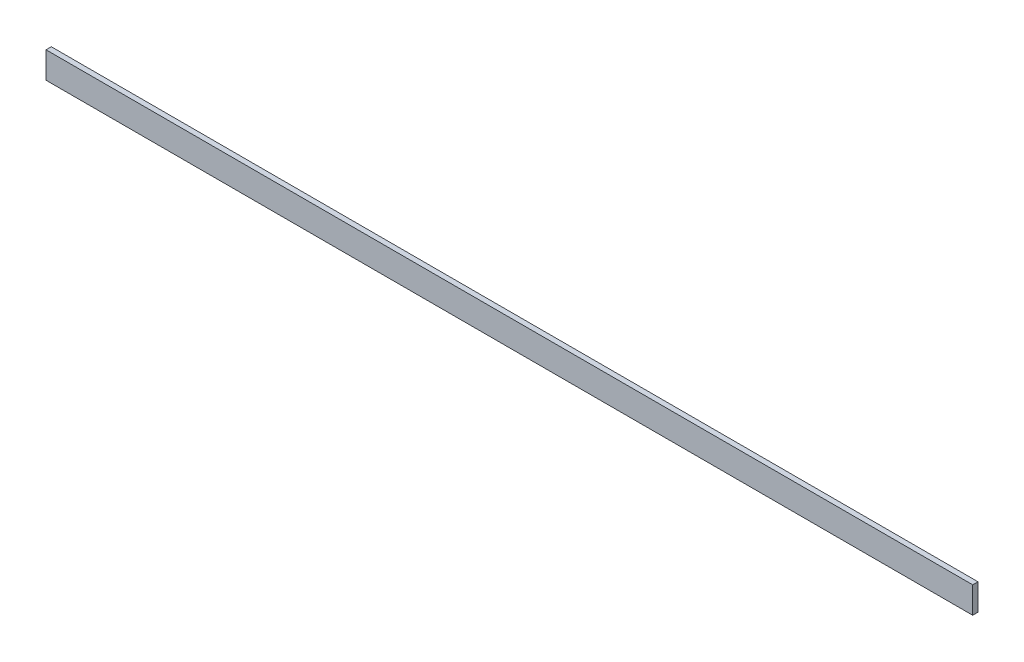
ISO-10303-21;
HEADER;
FILE_DESCRIPTION(('STEP AP214'),'2;1');
FILE_NAME('part.step','',(''),(''),'','','');
FILE_SCHEMA(('AUTOMOTIVE_DESIGN { 1 0 10303 214 1 1 1 1 }'));
ENDSEC;
DATA;
#1=APPLICATION_CONTEXT('core data for automotive mechanical design processes');
#2=APPLICATION_PROTOCOL_DEFINITION('international standard','automotive_design',2000,#1);
#3=PRODUCT_CONTEXT('',#1,'mechanical');
#4=PRODUCT('Part','Part','',(#3));
#5=PRODUCT_RELATED_PRODUCT_CATEGORY('part','',(#4));
#6=PRODUCT_DEFINITION_FORMATION('','',#4);
#7=PRODUCT_DEFINITION_CONTEXT('part definition',#1,'design');
#8=PRODUCT_DEFINITION('design','',#6,#7);
#9=PRODUCT_DEFINITION_SHAPE('','',#8);
#10=(LENGTH_UNIT() NAMED_UNIT(*) SI_UNIT(.MILLI.,.METRE.));
#11=(NAMED_UNIT(*) PLANE_ANGLE_UNIT() SI_UNIT($,.RADIAN.));
#12=(NAMED_UNIT(*) SI_UNIT($,.STERADIAN.) SOLID_ANGLE_UNIT());
#13=UNCERTAINTY_MEASURE_WITH_UNIT(LENGTH_MEASURE(1.E-05),#10,'distance_accuracy_value','');
#14=(GEOMETRIC_REPRESENTATION_CONTEXT(3) GLOBAL_UNCERTAINTY_ASSIGNED_CONTEXT((#13)) GLOBAL_UNIT_ASSIGNED_CONTEXT((#10,
#11,#12)) REPRESENTATION_CONTEXT('',''));
#15=CARTESIAN_POINT('',(0.,0.,0.));
#16=DIRECTION('',(0.,0.,1.));
#17=DIRECTION('',(1.,0.,0.));
#18=AXIS2_PLACEMENT_3D('',#15,#16,#17);
#19=CARTESIAN_POINT('',(-177.127492775907,4.72102869148791,2.));
#20=DIRECTION('',(1.,0.,0.));
#21=DIRECTION('',(0.,0.,-1.));
#22=AXIS2_PLACEMENT_3D('',#19,#20,#21);
#23=PLANE('',#22);
#24=DIRECTION('',(0.,-1.,0.));
#25=VECTOR('',#24,1.);
#26=CARTESIAN_POINT('',(-177.127492775907,4.72102869148791,0.));
#27=LINE('',#26,#25);
#28=CARTESIAN_POINT('',(-177.127492775907,4.72102869148791,0.));
#29=VERTEX_POINT('',#28);
#30=CARTESIAN_POINT('',(-177.127492775907,-5.27897130851209,0.));
#31=VERTEX_POINT('',#30);
#32=EDGE_CURVE('E96',#29,#31,#27,.T.);
#33=ORIENTED_EDGE('',*,*,#32,.T.);
#34=DIRECTION('',(0.,0.,-1.));
#35=VECTOR('',#34,1.);
#36=CARTESIAN_POINT('',(-177.127492775907,-5.27897130851209,2.));
#37=LINE('',#36,#35);
#38=CARTESIAN_POINT('',(-177.127492775907,-5.27897130851209,2.));
#39=VERTEX_POINT('',#38);
#40=EDGE_CURVE('E11',#39,#31,#37,.T.);
#41=ORIENTED_EDGE('',*,*,#40,.F.);
#42=DIRECTION('',(0.,-1.,0.));
#43=VECTOR('',#42,1.);
#44=CARTESIAN_POINT('',(-177.127492775907,4.72102869148791,2.));
#45=LINE('',#44,#43);
#46=CARTESIAN_POINT('',(-177.127492775907,4.72102869148791,2.));
#47=VERTEX_POINT('',#46);
#48=EDGE_CURVE('E84',#47,#39,#45,.T.);
#49=ORIENTED_EDGE('',*,*,#48,.F.);
#50=DIRECTION('',(0.,0.,-1.));
#51=VECTOR('',#50,1.);
#52=CARTESIAN_POINT('',(-177.127492775907,4.72102869148791,2.));
#53=LINE('',#52,#51);
#54=EDGE_CURVE('E92',#47,#29,#53,.T.);
#55=ORIENTED_EDGE('',*,*,#54,.T.);
#56=EDGE_LOOP('',(#33,#41,#49,#55));
#57=FACE_BOUND('',#56,.T.);
#58=ADVANCED_FACE('F33',(#57),#23,.F.);
#59=CARTESIAN_POINT('',(-177.127492775907,-5.27897130851209,2.));
#60=DIRECTION('',(0.,1.,0.));
#61=DIRECTION('',(0.,0.,1.));
#62=AXIS2_PLACEMENT_3D('',#59,#60,#61);
#63=PLANE('',#62);
#64=DIRECTION('',(1.,0.,0.));
#65=VECTOR('',#64,1.);
#66=CARTESIAN_POINT('',(-177.127492775907,-5.27897130851209,0.));
#67=LINE('',#66,#65);
#68=CARTESIAN_POINT('',(174.044424014093,-5.27897130851209,0.));
#69=VERTEX_POINT('',#68);
#70=EDGE_CURVE('E88',#31,#69,#67,.T.);
#71=ORIENTED_EDGE('',*,*,#70,.T.);
#72=DIRECTION('',(0.,0.,-1.));
#73=VECTOR('',#72,1.);
#74=CARTESIAN_POINT('',(174.044424014093,-5.27897130851209,2.));
#75=LINE('',#74,#73);
#76=CARTESIAN_POINT('',(174.044424014093,-5.27897130851209,2.));
#77=VERTEX_POINT('',#76);
#78=EDGE_CURVE('E41',#77,#69,#75,.T.);
#79=ORIENTED_EDGE('',*,*,#78,.F.);
#80=DIRECTION('',(1.,0.,0.));
#81=VECTOR('',#80,1.);
#82=CARTESIAN_POINT('',(-177.127492775907,-5.27897130851209,2.));
#83=LINE('',#82,#81);
#84=EDGE_CURVE('E79',#39,#77,#83,.T.);
#85=ORIENTED_EDGE('',*,*,#84,.F.);
#86=ORIENTED_EDGE('',*,*,#40,.T.);
#87=EDGE_LOOP('',(#71,#79,#85,#86));
#88=FACE_BOUND('',#87,.T.);
#89=ADVANCED_FACE('F87',(#88),#63,.F.);
#90=CARTESIAN_POINT('',(174.044424014093,4.72102869148791,2.));
#91=DIRECTION('',(-1.,0.,0.));
#92=DIRECTION('',(0.,0.,1.));
#93=AXIS2_PLACEMENT_3D('',#90,#91,#92);
#94=PLANE('',#93);
#95=DIRECTION('',(0.,1.,0.));
#96=VECTOR('',#95,1.);
#97=CARTESIAN_POINT('',(174.044424014093,4.72102869148791,0.));
#98=LINE('',#97,#96);
#99=CARTESIAN_POINT('',(174.044424014093,4.72102869148791,0.));
#100=VERTEX_POINT('',#99);
#101=EDGE_CURVE('E66',#69,#100,#98,.T.);
#102=ORIENTED_EDGE('',*,*,#101,.T.);
#103=DIRECTION('',(0.,0.,-1.));
#104=VECTOR('',#103,1.);
#105=CARTESIAN_POINT('',(174.044424014093,4.72102869148791,2.));
#106=LINE('',#105,#104);
#107=CARTESIAN_POINT('',(174.044424014093,4.72102869148791,2.));
#108=VERTEX_POINT('',#107);
#109=EDGE_CURVE('E89',#108,#100,#106,.T.);
#110=ORIENTED_EDGE('',*,*,#109,.F.);
#111=DIRECTION('',(0.,1.,0.));
#112=VECTOR('',#111,1.);
#113=CARTESIAN_POINT('',(174.044424014093,4.72102869148791,2.));
#114=LINE('',#113,#112);
#115=EDGE_CURVE('E82',#77,#108,#114,.T.);
#116=ORIENTED_EDGE('',*,*,#115,.F.);
#117=ORIENTED_EDGE('',*,*,#78,.T.);
#118=EDGE_LOOP('',(#102,#110,#116,#117));
#119=FACE_BOUND('',#118,.T.);
#120=ADVANCED_FACE('F90',(#119),#94,.F.);
#121=CARTESIAN_POINT('',(-177.127492775907,4.72102869148791,2.));
#122=DIRECTION('',(0.,-1.,0.));
#123=DIRECTION('',(0.,0.,-1.));
#124=AXIS2_PLACEMENT_3D('',#121,#122,#123);
#125=PLANE('',#124);
#126=DIRECTION('',(-1.,0.,0.));
#127=VECTOR('',#126,1.);
#128=CARTESIAN_POINT('',(-177.127492775907,4.72102869148791,0.));
#129=LINE('',#128,#127);
#130=EDGE_CURVE('E72',#100,#29,#129,.T.);
#131=ORIENTED_EDGE('',*,*,#130,.T.);
#132=ORIENTED_EDGE('',*,*,#54,.F.);
#133=DIRECTION('',(-1.,0.,0.));
#134=VECTOR('',#133,1.);
#135=CARTESIAN_POINT('',(-177.127492775907,4.72102869148791,2.));
#136=LINE('',#135,#134);
#137=EDGE_CURVE('E49',#108,#47,#136,.T.);
#138=ORIENTED_EDGE('',*,*,#137,.F.);
#139=ORIENTED_EDGE('',*,*,#109,.T.);
#140=EDGE_LOOP('',(#131,#132,#138,#139));
#141=FACE_BOUND('',#140,.T.);
#142=ADVANCED_FACE('F103',(#141),#125,.F.);
#143=CARTESIAN_POINT('',(0.,0.,2.));
#144=DIRECTION('',(0.,0.,1.));
#145=DIRECTION('',(1.,0.,0.));
#146=AXIS2_PLACEMENT_3D('',#143,#144,#145);
#147=PLANE('',#146);
#148=ORIENTED_EDGE('',*,*,#48,.T.);
#149=ORIENTED_EDGE('',*,*,#84,.T.);
#150=ORIENTED_EDGE('',*,*,#115,.T.);
#151=ORIENTED_EDGE('',*,*,#137,.T.);
#152=EDGE_LOOP('',(#148,#149,#150,#151));
#153=FACE_BOUND('',#152,.T.);
#154=ADVANCED_FACE('F80',(#153),#147,.T.);
#155=CARTESIAN_POINT('',(0.,0.,0.));
#156=DIRECTION('',(0.,0.,1.));
#157=DIRECTION('',(1.,0.,0.));
#158=AXIS2_PLACEMENT_3D('',#155,#156,#157);
#159=PLANE('',#158);
#160=ORIENTED_EDGE('',*,*,#32,.F.);
#161=ORIENTED_EDGE('',*,*,#130,.F.);
#162=ORIENTED_EDGE('',*,*,#101,.F.);
#163=ORIENTED_EDGE('',*,*,#70,.F.);
#164=EDGE_LOOP('',(#160,#161,#162,#163));
#165=FACE_BOUND('',#164,.T.);
#166=ADVANCED_FACE('F106',(#165),#159,.F.);
#167=CLOSED_SHELL('',(#58,#89,#120,#142,#154,#166));
#168=MANIFOLD_SOLID_BREP('B2',#167);
#169=ADVANCED_BREP_SHAPE_REPRESENTATION('',(#18,#168),#14);
#170=SHAPE_DEFINITION_REPRESENTATION(#9,#169);
ENDSEC;
END-ISO-10303-21;
